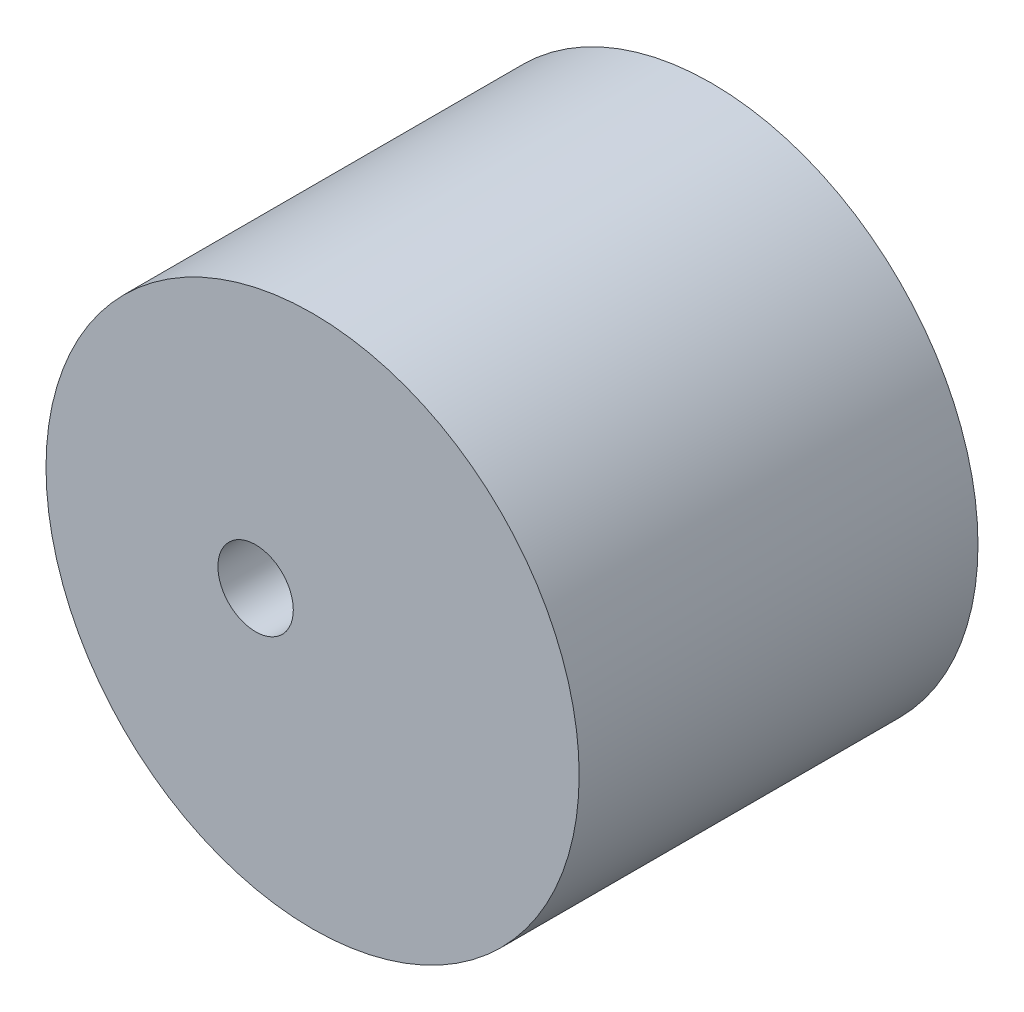
ISO-10303-21;
HEADER;
FILE_DESCRIPTION(('STEP AP214'),'2;1');
FILE_NAME('part.step','',(''),(''),'','','');
FILE_SCHEMA(('AUTOMOTIVE_DESIGN { 1 0 10303 214 1 1 1 1 }'));
ENDSEC;
DATA;
#1=APPLICATION_CONTEXT('core data for automotive mechanical design processes');
#2=APPLICATION_PROTOCOL_DEFINITION('international standard','automotive_design',2000,#1);
#3=PRODUCT_CONTEXT('',#1,'mechanical');
#4=PRODUCT('Part','Part','',(#3));
#5=PRODUCT_RELATED_PRODUCT_CATEGORY('part','',(#4));
#6=PRODUCT_DEFINITION_FORMATION('','',#4);
#7=PRODUCT_DEFINITION_CONTEXT('part definition',#1,'design');
#8=PRODUCT_DEFINITION('design','',#6,#7);
#9=PRODUCT_DEFINITION_SHAPE('','',#8);
#10=(LENGTH_UNIT() NAMED_UNIT(*) SI_UNIT(.MILLI.,.METRE.));
#11=(NAMED_UNIT(*) PLANE_ANGLE_UNIT() SI_UNIT($,.RADIAN.));
#12=(NAMED_UNIT(*) SI_UNIT($,.STERADIAN.) SOLID_ANGLE_UNIT());
#13=UNCERTAINTY_MEASURE_WITH_UNIT(LENGTH_MEASURE(1.E-05),#10,'distance_accuracy_value','');
#14=(GEOMETRIC_REPRESENTATION_CONTEXT(3) GLOBAL_UNCERTAINTY_ASSIGNED_CONTEXT((#13)) GLOBAL_UNIT_ASSIGNED_CONTEXT((#10,
#11,#12)) REPRESENTATION_CONTEXT('',''));
#15=CARTESIAN_POINT('',(0.,0.,0.));
#16=DIRECTION('',(0.,0.,1.));
#17=DIRECTION('',(1.,0.,0.));
#18=AXIS2_PLACEMENT_3D('',#15,#16,#17);
#19=CARTESIAN_POINT('',(0.,0.,35.));
#20=DIRECTION('',(0.,0.,1.));
#21=DIRECTION('',(1.,0.,0.));
#22=AXIS2_PLACEMENT_3D('',#19,#20,#21);
#23=PLANE('',#22);
#24=CARTESIAN_POINT('',(0.,0.,35.));
#25=DIRECTION('',(0.,0.,1.));
#26=DIRECTION('',(1.,0.,0.));
#27=AXIS2_PLACEMENT_3D('',#24,#25,#26);
#28=CIRCLE('',#27,23.39375);
#29=CARTESIAN_POINT('',(23.39375,0.,35.));
#30=VERTEX_POINT('',#29);
#31=EDGE_CURVE('E10',#30,#30,#28,.T.);
#32=ORIENTED_EDGE('',*,*,#31,.T.);
#33=EDGE_LOOP('',(#32));
#34=FACE_BOUND('',#33,.T.);
#35=CARTESIAN_POINT('',(-5.,0.,35.));
#36=DIRECTION('',(0.,0.,1.));
#37=DIRECTION('',(1.,0.,0.));
#38=AXIS2_PLACEMENT_3D('',#35,#36,#37);
#39=CIRCLE('',#38,3.3085);
#40=CARTESIAN_POINT('',(-1.6915,0.,35.));
#41=VERTEX_POINT('',#40);
#42=EDGE_CURVE('E50',#41,#41,#39,.T.);
#43=ORIENTED_EDGE('',*,*,#42,.F.);
#44=EDGE_LOOP('',(#43));
#45=FACE_BOUND('',#44,.T.);
#46=ADVANCED_FACE('F37',(#34,#45),#23,.T.);
#47=CARTESIAN_POINT('',(0.,0.,0.));
#48=DIRECTION('',(0.,0.,1.));
#49=DIRECTION('',(1.,0.,0.));
#50=AXIS2_PLACEMENT_3D('',#47,#48,#49);
#51=PLANE('',#50);
#52=CARTESIAN_POINT('',(0.,0.,0.));
#53=DIRECTION('',(0.,0.,1.));
#54=DIRECTION('',(1.,0.,0.));
#55=AXIS2_PLACEMENT_3D('',#52,#53,#54);
#56=CIRCLE('',#55,23.39375);
#57=CARTESIAN_POINT('',(23.39375,0.,0.));
#58=VERTEX_POINT('',#57);
#59=EDGE_CURVE('E41',#58,#58,#56,.T.);
#60=ORIENTED_EDGE('',*,*,#59,.F.);
#61=EDGE_LOOP('',(#60));
#62=FACE_BOUND('',#61,.T.);
#63=CARTESIAN_POINT('',(-5.,0.,0.));
#64=DIRECTION('',(0.,0.,1.));
#65=DIRECTION('',(1.,0.,0.));
#66=AXIS2_PLACEMENT_3D('',#63,#64,#65);
#67=CIRCLE('',#66,3.3085);
#68=CARTESIAN_POINT('',(-1.6915,0.,0.));
#69=VERTEX_POINT('',#68);
#70=EDGE_CURVE('E52',#69,#69,#67,.T.);
#71=ORIENTED_EDGE('',*,*,#70,.T.);
#72=EDGE_LOOP('',(#71));
#73=FACE_BOUND('',#72,.T.);
#74=ADVANCED_FACE('F64',(#62,#73),#51,.F.);
#75=CARTESIAN_POINT('',(0.,0.,35.));
#76=DIRECTION('',(0.,0.,-1.));
#77=DIRECTION('',(-1.,0.,0.));
#78=AXIS2_PLACEMENT_3D('',#75,#76,#77);
#79=CYLINDRICAL_SURFACE('',#78,23.39375);
#80=ORIENTED_EDGE('',*,*,#31,.F.);
#81=EDGE_LOOP('',(#80));
#82=FACE_BOUND('',#81,.T.);
#83=ORIENTED_EDGE('',*,*,#59,.T.);
#84=EDGE_LOOP('',(#83));
#85=FACE_BOUND('',#84,.T.);
#86=ADVANCED_FACE('F39',(#82,#85),#79,.T.);
#87=CARTESIAN_POINT('',(-5.,0.,35.));
#88=DIRECTION('',(0.,0.,-1.));
#89=DIRECTION('',(-1.,0.,0.));
#90=AXIS2_PLACEMENT_3D('',#87,#88,#89);
#91=CYLINDRICAL_SURFACE('',#90,3.3085);
#92=ORIENTED_EDGE('',*,*,#42,.T.);
#93=EDGE_LOOP('',(#92));
#94=FACE_BOUND('',#93,.T.);
#95=ORIENTED_EDGE('',*,*,#70,.F.);
#96=EDGE_LOOP('',(#95));
#97=FACE_BOUND('',#96,.T.);
#98=ADVANCED_FACE('F60',(#94,#97),#91,.F.);
#99=CLOSED_SHELL('',(#46,#74,#86,#98));
#100=MANIFOLD_SOLID_BREP('B2',#99);
#101=ADVANCED_BREP_SHAPE_REPRESENTATION('',(#18,#100),#14);
#102=SHAPE_DEFINITION_REPRESENTATION(#9,#101);
ENDSEC;
END-ISO-10303-21;
